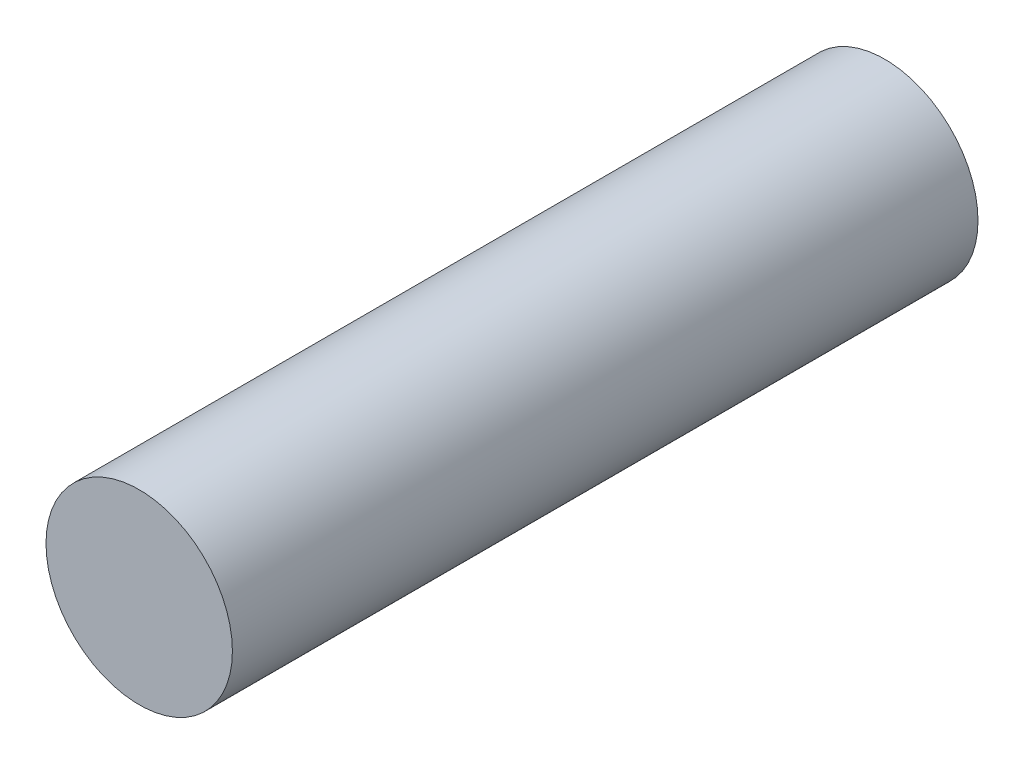
ISO-10303-21;
HEADER;
FILE_DESCRIPTION(('STEP AP214'),'2;1');
FILE_NAME('part.step','',(''),(''),'','','');
FILE_SCHEMA(('AUTOMOTIVE_DESIGN { 1 0 10303 214 1 1 1 1 }'));
ENDSEC;
DATA;
#1=APPLICATION_CONTEXT('core data for automotive mechanical design processes');
#2=APPLICATION_PROTOCOL_DEFINITION('international standard','automotive_design',2000,#1);
#3=PRODUCT_CONTEXT('',#1,'mechanical');
#4=PRODUCT('Part','Part','',(#3));
#5=PRODUCT_RELATED_PRODUCT_CATEGORY('part','',(#4));
#6=PRODUCT_DEFINITION_FORMATION('','',#4);
#7=PRODUCT_DEFINITION_CONTEXT('part definition',#1,'design');
#8=PRODUCT_DEFINITION('design','',#6,#7);
#9=PRODUCT_DEFINITION_SHAPE('','',#8);
#10=(LENGTH_UNIT() NAMED_UNIT(*) SI_UNIT(.MILLI.,.METRE.));
#11=(NAMED_UNIT(*) PLANE_ANGLE_UNIT() SI_UNIT($,.RADIAN.));
#12=(NAMED_UNIT(*) SI_UNIT($,.STERADIAN.) SOLID_ANGLE_UNIT());
#13=UNCERTAINTY_MEASURE_WITH_UNIT(LENGTH_MEASURE(1.E-05),#10,'distance_accuracy_value','');
#14=(GEOMETRIC_REPRESENTATION_CONTEXT(3) GLOBAL_UNCERTAINTY_ASSIGNED_CONTEXT((#13)) GLOBAL_UNIT_ASSIGNED_CONTEXT((#10,
#11,#12)) REPRESENTATION_CONTEXT('',''));
#15=CARTESIAN_POINT('',(0.,0.,0.));
#16=DIRECTION('',(0.,0.,1.));
#17=DIRECTION('',(1.,0.,0.));
#18=AXIS2_PLACEMENT_3D('',#15,#16,#17);
#19=CARTESIAN_POINT('',(0.,0.,25.4));
#20=DIRECTION('',(0.,0.,-1.));
#21=DIRECTION('',(-1.,0.,0.));
#22=AXIS2_PLACEMENT_3D('',#19,#20,#21);
#23=CYLINDRICAL_SURFACE('',#22,3.175);
#24=CARTESIAN_POINT('',(0.,0.,25.4));
#25=DIRECTION('',(0.,0.,1.));
#26=DIRECTION('',(1.,0.,0.));
#27=AXIS2_PLACEMENT_3D('',#24,#25,#26);
#28=CIRCLE('',#27,3.175);
#29=CARTESIAN_POINT('',(3.175,0.,25.4));
#30=VERTEX_POINT('',#29);
#31=EDGE_CURVE('E10',#30,#30,#28,.T.);
#32=ORIENTED_EDGE('',*,*,#31,.F.);
#33=EDGE_LOOP('',(#32));
#34=FACE_BOUND('',#33,.T.);
#35=CARTESIAN_POINT('',(0.,0.,0.));
#36=DIRECTION('',(0.,0.,1.));
#37=DIRECTION('',(1.,0.,0.));
#38=AXIS2_PLACEMENT_3D('',#35,#36,#37);
#39=CIRCLE('',#38,3.175);
#40=CARTESIAN_POINT('',(3.175,0.,0.));
#41=VERTEX_POINT('',#40);
#42=EDGE_CURVE('E35',#41,#41,#39,.T.);
#43=ORIENTED_EDGE('',*,*,#42,.T.);
#44=EDGE_LOOP('',(#43));
#45=FACE_BOUND('',#44,.T.);
#46=ADVANCED_FACE('F32',(#34,#45),#23,.T.);
#47=CARTESIAN_POINT('',(0.,0.,25.4));
#48=DIRECTION('',(0.,0.,1.));
#49=DIRECTION('',(1.,0.,0.));
#50=AXIS2_PLACEMENT_3D('',#47,#48,#49);
#51=PLANE('',#50);
#52=ORIENTED_EDGE('',*,*,#31,.T.);
#53=EDGE_LOOP('',(#52));
#54=FACE_BOUND('',#53,.T.);
#55=ADVANCED_FACE('F47',(#54),#51,.T.);
#56=CARTESIAN_POINT('',(0.,0.,0.));
#57=DIRECTION('',(0.,0.,1.));
#58=DIRECTION('',(1.,0.,0.));
#59=AXIS2_PLACEMENT_3D('',#56,#57,#58);
#60=PLANE('',#59);
#61=ORIENTED_EDGE('',*,*,#42,.F.);
#62=EDGE_LOOP('',(#61));
#63=FACE_BOUND('',#62,.T.);
#64=ADVANCED_FACE('F45',(#63),#60,.F.);
#65=CLOSED_SHELL('',(#46,#55,#64));
#66=MANIFOLD_SOLID_BREP('B2',#65);
#67=ADVANCED_BREP_SHAPE_REPRESENTATION('',(#18,#66),#14);
#68=SHAPE_DEFINITION_REPRESENTATION(#9,#67);
ENDSEC;
END-ISO-10303-21;
